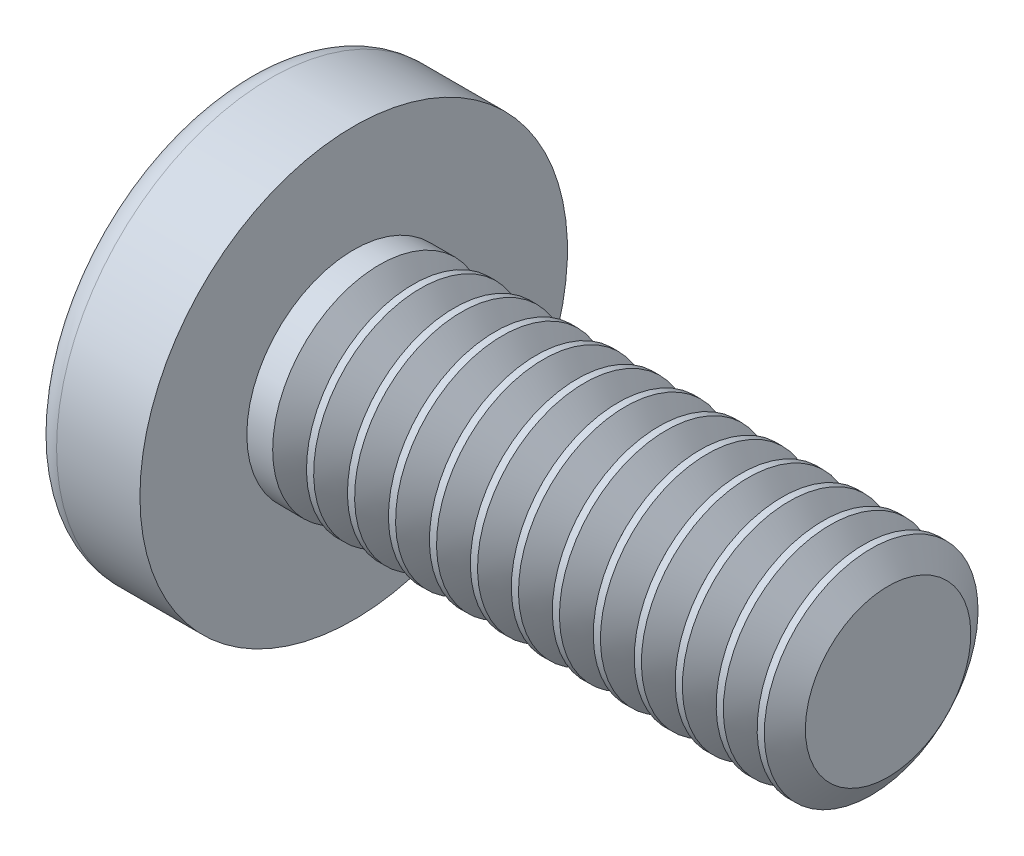
ISO-10303-21;
HEADER;
FILE_DESCRIPTION(('STEP AP214'),'2;1');
FILE_NAME('part.step','',(''),(''),'','','');
FILE_SCHEMA(('AUTOMOTIVE_DESIGN { 1 0 10303 214 1 1 1 1 }'));
ENDSEC;
DATA;
#1=APPLICATION_CONTEXT('core data for automotive mechanical design processes');
#2=APPLICATION_PROTOCOL_DEFINITION('international standard','automotive_design',2000,#1);
#3=PRODUCT_CONTEXT('',#1,'mechanical');
#4=PRODUCT('Part','Part','',(#3));
#5=PRODUCT_RELATED_PRODUCT_CATEGORY('part','',(#4));
#6=PRODUCT_DEFINITION_FORMATION('','',#4);
#7=PRODUCT_DEFINITION_CONTEXT('part definition',#1,'design');
#8=PRODUCT_DEFINITION('design','',#6,#7);
#9=PRODUCT_DEFINITION_SHAPE('','',#8);
#10=(LENGTH_UNIT() NAMED_UNIT(*) SI_UNIT(.MILLI.,.METRE.));
#11=(NAMED_UNIT(*) PLANE_ANGLE_UNIT() SI_UNIT($,.RADIAN.));
#12=(NAMED_UNIT(*) SI_UNIT($,.STERADIAN.) SOLID_ANGLE_UNIT());
#13=UNCERTAINTY_MEASURE_WITH_UNIT(LENGTH_MEASURE(1.E-05),#10,'distance_accuracy_value','');
#14=(GEOMETRIC_REPRESENTATION_CONTEXT(3) GLOBAL_UNCERTAINTY_ASSIGNED_CONTEXT((#13)) GLOBAL_UNIT_ASSIGNED_CONTEXT((#10,
#11,#12)) REPRESENTATION_CONTEXT('',''));
#15=CARTESIAN_POINT('',(0.,0.,0.));
#16=DIRECTION('',(0.,0.,1.));
#17=DIRECTION('',(1.,0.,0.));
#18=AXIS2_PLACEMENT_3D('',#15,#16,#17);
#19=CARTESIAN_POINT('',(3.2,0.,0.));
#20=DIRECTION('',(-1.,0.,0.));
#21=DIRECTION('',(0.,1.,0.));
#22=AXIS2_PLACEMENT_3D('',#19,#20,#21);
#23=SPHERICAL_SURFACE('',#22,3.2);
#24=CARTESIAN_POINT('',(0.627117875780583,0.,0.));
#25=DIRECTION('',(-1.,0.,0.));
#26=DIRECTION('',(0.,0.,1.));
#27=AXIS2_PLACEMENT_3D('',#24,#25,#26);
#28=CIRCLE('',#27,1.9027027027027);
#29=CARTESIAN_POINT('',(0.627117875780583,0.,1.9027027027027));
#30=VERTEX_POINT('',#29);
#31=EDGE_CURVE('E150',#30,#30,#28,.T.);
#32=ORIENTED_EDGE('',*,*,#31,.T.);
#33=EDGE_LOOP('',(#32));
#34=FACE_BOUND('',#33,.T.);
#35=CARTESIAN_POINT('',(3.19174554351625,-0.0818566934638238,0.));
#36=DIRECTION('',(-0.100331502261418,-0.994954064092392,0.));
#37=DIRECTION('',(0.994954064092392,-0.100331502261418,0.));
#38=AXIS2_PLACEMENT_3D('',#35,#36,#37);
#39=CIRCLE('',#38,3.1989422229361);
#40=CARTESIAN_POINT('',(0.118330716626357,0.228067490760364,0.831444314172419));
#41=VERTEX_POINT('',#40);
#42=CARTESIAN_POINT('',(0.0177814447975956,0.238206913129653,0.238206913129654));
#43=VERTEX_POINT('',#42);
#44=EDGE_CURVE('E181',#41,#43,#39,.T.);
#45=ORIENTED_EDGE('',*,*,#44,.F.);
#46=CARTESIAN_POINT('',(2.64043280070581,0.,-0.842892363493775));
#47=DIRECTION('',(0.553083521918191,0.,0.833125811497021));
#48=DIRECTION('',(0.833125811497021,0.,-0.553083521918191));
#49=AXIS2_PLACEMENT_3D('',#46,#47,#48);
#50=CIRCLE('',#49,3.03585523585001);
#51=CARTESIAN_POINT('',(0.118330716626356,-0.22806749076037,0.831444314172419));
#52=VERTEX_POINT('',#51);
#53=EDGE_CURVE('E149',#41,#52,#50,.T.);
#54=ORIENTED_EDGE('',*,*,#53,.T.);
#55=CARTESIAN_POINT('',(3.19174554351625,0.081856693463823,0.));
#56=DIRECTION('',(-0.100331502261417,0.994954064092392,0.));
#57=DIRECTION('',(-0.994954064092392,-0.100331502261417,0.));
#58=AXIS2_PLACEMENT_3D('',#55,#56,#57);
#59=CIRCLE('',#58,3.1989422229361);
#60=CARTESIAN_POINT('',(0.0177814447975943,-0.238206913129655,0.238206913129654));
#61=VERTEX_POINT('',#60);
#62=EDGE_CURVE('E105',#61,#52,#59,.T.);
#63=ORIENTED_EDGE('',*,*,#62,.F.);
#64=CARTESIAN_POINT('',(3.19174554351625,0.,-0.081856693463823));
#65=DIRECTION('',(-0.100331502261417,0.,-0.994954064092392));
#66=DIRECTION('',(-0.994954064092392,0.,0.100331502261417));
#67=AXIS2_PLACEMENT_3D('',#64,#65,#66);
#68=CIRCLE('',#67,3.1989422229361);
#69=CARTESIAN_POINT('',(0.118330716626355,-0.831444314172419,0.228067490760367));
#70=VERTEX_POINT('',#69);
#71=EDGE_CURVE('E130',#70,#61,#68,.T.);
#72=ORIENTED_EDGE('',*,*,#71,.F.);
#73=CARTESIAN_POINT('',(2.64043280070581,0.842892363493772,0.));
#74=DIRECTION('',(0.55308352191819,-0.833125811497022,0.));
#75=DIRECTION('',(0.833125811497022,0.55308352191819,0.));
#76=AXIS2_PLACEMENT_3D('',#73,#74,#75);
#77=CIRCLE('',#76,3.03585523585001);
#78=CARTESIAN_POINT('',(0.118330716626355,-0.831444314172419,-0.228067490760368));
#79=VERTEX_POINT('',#78);
#80=EDGE_CURVE('E138',#70,#79,#77,.T.);
#81=ORIENTED_EDGE('',*,*,#80,.T.);
#82=CARTESIAN_POINT('',(3.19174554351625,0.,0.0818566934638238));
#83=DIRECTION('',(-0.100331502261418,0.,0.994954064092392));
#84=DIRECTION('',(0.994954064092392,0.,0.100331502261418));
#85=AXIS2_PLACEMENT_3D('',#82,#83,#84);
#86=CIRCLE('',#85,3.1989422229361);
#87=CARTESIAN_POINT('',(0.0177814447975947,-0.238206913129653,-0.238206913129654));
#88=VERTEX_POINT('',#87);
#89=EDGE_CURVE('E48',#88,#79,#86,.T.);
#90=ORIENTED_EDGE('',*,*,#89,.F.);
#91=CARTESIAN_POINT('',(0.118330716626356,-0.228067490760364,-0.831444314172419));
#92=VERTEX_POINT('',#91);
#93=EDGE_CURVE('E188',#92,#88,#59,.T.);
#94=ORIENTED_EDGE('',*,*,#93,.F.);
#95=CARTESIAN_POINT('',(2.64043280070581,0.,0.842892363493774));
#96=DIRECTION('',(0.55308352191819,0.,-0.833125811497022));
#97=DIRECTION('',(-0.833125811497022,0.,-0.55308352191819));
#98=AXIS2_PLACEMENT_3D('',#95,#96,#97);
#99=CIRCLE('',#98,3.03585523585001);
#100=CARTESIAN_POINT('',(0.118330716626357,0.22806749076037,-0.831444314172417));
#101=VERTEX_POINT('',#100);
#102=EDGE_CURVE('E131',#92,#101,#99,.T.);
#103=ORIENTED_EDGE('',*,*,#102,.T.);
#104=CARTESIAN_POINT('',(0.0177814447975956,0.238206913129655,-0.238206913129654));
#105=VERTEX_POINT('',#104);
#106=EDGE_CURVE('E176',#105,#101,#39,.T.);
#107=ORIENTED_EDGE('',*,*,#106,.F.);
#108=CARTESIAN_POINT('',(0.118330716626357,0.831444314172418,-0.228067490760367));
#109=VERTEX_POINT('',#108);
#110=EDGE_CURVE('E41',#109,#105,#86,.T.);
#111=ORIENTED_EDGE('',*,*,#110,.F.);
#112=CARTESIAN_POINT('',(2.64043280070582,-0.842892363493777,0.));
#113=DIRECTION('',(0.553083521918191,0.833125811497021,0.));
#114=DIRECTION('',(-0.833125811497021,0.553083521918191,0.));
#115=AXIS2_PLACEMENT_3D('',#112,#113,#114);
#116=CIRCLE('',#115,3.03585523585001);
#117=CARTESIAN_POINT('',(0.118330716626358,0.831444314172418,0.228067490760367));
#118=VERTEX_POINT('',#117);
#119=EDGE_CURVE('E11',#109,#118,#116,.T.);
#120=ORIENTED_EDGE('',*,*,#119,.T.);
#121=EDGE_CURVE('E164',#43,#118,#68,.T.);
#122=ORIENTED_EDGE('',*,*,#121,.F.);
#123=EDGE_LOOP('',(#45,#54,#63,#72,#81,#90,#94,#103,#107,#111,#120,#122));
#124=FACE_BOUND('',#123,.T.);
#125=ADVANCED_FACE('F33',(#34,#124),#23,.T.);
#126=CARTESIAN_POINT('',(1.37075949367089,0.,-0.101772151898734));
#127=DIRECTION('',(-0.100331502261418,0.,0.994954064092392));
#128=DIRECTION('',(0.994954064092392,0.,0.100331502261418));
#129=AXIS2_PLACEMENT_3D('',#126,#127,#128);
#130=PLANE('',#129);
#131=ORIENTED_EDGE('',*,*,#110,.T.);
#132=DIRECTION('',(0.989983749746913,-0.099830294092126,0.0998302940921257));
#133=VECTOR('',#132,1.);
#134=CARTESIAN_POINT('',(1.38081767298512,0.100757881715786,-0.100757881715786));
#135=LINE('',#134,#133);
#136=CARTESIAN_POINT('',(1.19,0.12,-0.12));
#137=VERTEX_POINT('',#136);
#138=EDGE_CURVE('E170',#105,#137,#135,.T.);
#139=ORIENTED_EDGE('',*,*,#138,.T.);
#140=DIRECTION('',(0.830201128729582,-0.551141925795269,0.083717760880294));
#141=VECTOR('',#140,1.);
#142=CARTESIAN_POINT('',(0.,0.91,-0.24));
#143=LINE('',#142,#141);
#144=EDGE_CURVE('E154',#109,#137,#143,.T.);
#145=ORIENTED_EDGE('',*,*,#144,.F.);
#146=EDGE_LOOP('',(#131,#139,#145));
#147=FACE_BOUND('',#146,.T.);
#148=ADVANCED_FACE('F169',(#147),#130,.T.);
#149=DIRECTION('',(0.830201128729583,0.551141925795268,0.083717760880294));
#150=VECTOR('',#149,1.);
#151=CARTESIAN_POINT('',(0.,-0.909999999999998,-0.24));
#152=LINE('',#151,#150);
#153=CARTESIAN_POINT('',(1.19,-0.12,-0.12));
#154=VERTEX_POINT('',#153);
#155=EDGE_CURVE('E139',#79,#154,#152,.T.);
#156=ORIENTED_EDGE('',*,*,#155,.T.);
#157=DIRECTION('',(-0.989983749746913,-0.0998302940921249,-0.0998302940921257));
#158=VECTOR('',#157,1.);
#159=CARTESIAN_POINT('',(1.38081767298512,-0.100757881715786,-0.100757881715786));
#160=LINE('',#159,#158);
#161=EDGE_CURVE('E191',#154,#88,#160,.T.);
#162=ORIENTED_EDGE('',*,*,#161,.T.);
#163=ORIENTED_EDGE('',*,*,#89,.T.);
#164=EDGE_LOOP('',(#156,#162,#163));
#165=FACE_BOUND('',#164,.T.);
#166=ADVANCED_FACE('F333',(#165),#130,.T.);
#167=CARTESIAN_POINT('',(1.37075949367089,0.,0.101772151898734));
#168=DIRECTION('',(-0.100331502261417,0.,-0.994954064092392));
#169=DIRECTION('',(-0.994954064092392,0.,0.100331502261417));
#170=AXIS2_PLACEMENT_3D('',#167,#168,#169);
#171=PLANE('',#170);
#172=DIRECTION('',(0.830201128729582,-0.551141925795269,-0.0837177608802936));
#173=VECTOR('',#172,1.);
#174=CARTESIAN_POINT('',(0.,0.91,0.239999999999999));
#175=LINE('',#174,#173);
#176=CARTESIAN_POINT('',(1.19,0.12,0.12));
#177=VERTEX_POINT('',#176);
#178=EDGE_CURVE('E864',#118,#177,#175,.T.);
#179=ORIENTED_EDGE('',*,*,#178,.T.);
#180=DIRECTION('',(-0.989983749746913,0.0998302940921253,0.0998302940921253));
#181=VECTOR('',#180,1.);
#182=CARTESIAN_POINT('',(1.38081767298512,0.100757881715786,0.100757881715786));
#183=LINE('',#182,#181);
#184=EDGE_CURVE('E185',#177,#43,#183,.T.);
#185=ORIENTED_EDGE('',*,*,#184,.T.);
#186=ORIENTED_EDGE('',*,*,#121,.T.);
#187=EDGE_LOOP('',(#179,#185,#186));
#188=FACE_BOUND('',#187,.T.);
#189=ADVANCED_FACE('F363',(#188),#171,.T.);
#190=ORIENTED_EDGE('',*,*,#71,.T.);
#191=DIRECTION('',(0.989983749746913,0.0998302940921256,-0.0998302940921253));
#192=VECTOR('',#191,1.);
#193=CARTESIAN_POINT('',(1.38081767298512,-0.100757881715786,0.100757881715786));
#194=LINE('',#193,#192);
#195=CARTESIAN_POINT('',(1.19,-0.12,0.119999999999999));
#196=VERTEX_POINT('',#195);
#197=EDGE_CURVE('E103',#61,#196,#194,.T.);
#198=ORIENTED_EDGE('',*,*,#197,.T.);
#199=DIRECTION('',(0.830201128729583,0.551141925795268,-0.0837177608802937));
#200=VECTOR('',#199,1.);
#201=CARTESIAN_POINT('',(0.,-0.909999999999998,0.239999999999999));
#202=LINE('',#201,#200);
#203=EDGE_CURVE('E128',#70,#196,#202,.T.);
#204=ORIENTED_EDGE('',*,*,#203,.F.);
#205=EDGE_LOOP('',(#190,#198,#204));
#206=FACE_BOUND('',#205,.T.);
#207=ADVANCED_FACE('F127',(#206),#171,.T.);
#208=CARTESIAN_POINT('',(-25.4,0.,0.));
#209=DIRECTION('',(-1.,0.,0.));
#210=DIRECTION('',(0.,0.,1.));
#211=AXIS2_PLACEMENT_3D('',#208,#209,#210);
#212=CYLINDRICAL_SURFACE('',#211,1.);
#213=CARTESIAN_POINT('',(1.84175309636461,0.,0.));
#214=DIRECTION('',(-1.,0.,0.));
#215=DIRECTION('',(0.,-1.,0.));
#216=AXIS2_PLACEMENT_3D('',#213,#214,#215);
#217=CIRCLE('',#216,1.);
#218=CARTESIAN_POINT('',(1.84175309636461,-0.999999999999999,0.));
#219=VERTEX_POINT('',#218);
#220=EDGE_CURVE('E203',#219,#219,#217,.T.);
#221=ORIENTED_EDGE('',*,*,#220,.T.);
#222=EDGE_LOOP('',(#221));
#223=FACE_BOUND('',#222,.T.);
#224=CARTESIAN_POINT('',(1.6,0.,0.));
#225=DIRECTION('',(-1.,0.,0.));
#226=DIRECTION('',(0.,0.,1.));
#227=AXIS2_PLACEMENT_3D('',#224,#225,#226);
#228=CIRCLE('',#227,1.);
#229=CARTESIAN_POINT('',(1.6,0.,1.));
#230=VERTEX_POINT('',#229);
#231=EDGE_CURVE('E160',#230,#230,#228,.T.);
#232=ORIENTED_EDGE('',*,*,#231,.F.);
#233=EDGE_LOOP('',(#232));
#234=FACE_BOUND('',#233,.T.);
#235=ADVANCED_FACE('F35',(#223,#234),#212,.T.);
#236=CARTESIAN_POINT('',(1.6,1.,0.));
#237=DIRECTION('',(-1.,0.,0.));
#238=DIRECTION('',(0.,0.,1.));
#239=AXIS2_PLACEMENT_3D('',#236,#237,#238);
#240=PLANE('',#239);
#241=CARTESIAN_POINT('',(1.6,0.,0.));
#242=DIRECTION('',(-1.,0.,0.));
#243=DIRECTION('',(0.,0.,1.));
#244=AXIS2_PLACEMENT_3D('',#241,#242,#243);
#245=CIRCLE('',#244,2.);
#246=CARTESIAN_POINT('',(1.6,0.,2.));
#247=VERTEX_POINT('',#246);
#248=EDGE_CURVE('E157',#247,#247,#245,.T.);
#249=ORIENTED_EDGE('',*,*,#248,.F.);
#250=EDGE_LOOP('',(#249));
#251=FACE_BOUND('',#250,.T.);
#252=ORIENTED_EDGE('',*,*,#231,.T.);
#253=EDGE_LOOP('',(#252));
#254=FACE_BOUND('',#253,.T.);
#255=ADVANCED_FACE('F343',(#251,#254),#240,.F.);
#256=CARTESIAN_POINT('',(-25.4,0.,0.));
#257=DIRECTION('',(-1.,0.,0.));
#258=DIRECTION('',(0.,0.,1.));
#259=AXIS2_PLACEMENT_3D('',#256,#257,#258);
#260=CYLINDRICAL_SURFACE('',#259,2.);
#261=ORIENTED_EDGE('',*,*,#248,.T.);
#262=EDGE_LOOP('',(#261));
#263=FACE_BOUND('',#262,.T.);
#264=CARTESIAN_POINT('',(0.820084035097042,0.,0.));
#265=DIRECTION('',(-1.,0.,0.));
#266=DIRECTION('',(0.,0.,1.));
#267=AXIS2_PLACEMENT_3D('',#264,#265,#266);
#268=CIRCLE('',#267,2.);
#269=CARTESIAN_POINT('',(0.820084035097042,0.,2.));
#270=VERTEX_POINT('',#269);
#271=EDGE_CURVE('E153',#270,#270,#268,.T.);
#272=ORIENTED_EDGE('',*,*,#271,.F.);
#273=EDGE_LOOP('',(#272));
#274=FACE_BOUND('',#273,.T.);
#275=ADVANCED_FACE('F340',(#263,#274),#260,.T.);
#276=CARTESIAN_POINT('',(0.820084035097042,0.,0.));
#277=DIRECTION('',(-1.,0.,0.));
#278=DIRECTION('',(0.,0.,1.));
#279=AXIS2_PLACEMENT_3D('',#276,#277,#278);
#280=TOROIDAL_SURFACE('',#279,1.76,0.24);
#281=ORIENTED_EDGE('',*,*,#271,.T.);
#282=EDGE_LOOP('',(#281));
#283=FACE_BOUND('',#282,.T.);
#284=ORIENTED_EDGE('',*,*,#31,.F.);
#285=EDGE_LOOP('',(#284));
#286=FACE_BOUND('',#285,.T.);
#287=ADVANCED_FACE('F336',(#283,#286),#280,.T.);
#288=CARTESIAN_POINT('',(1.19,0.12,0.12));
#289=DIRECTION('',(0.553083521918191,0.833125811497021,0.));
#290=DIRECTION('',(-0.833125811497021,0.553083521918191,0.));
#291=AXIS2_PLACEMENT_3D('',#288,#289,#290);
#292=PLANE('',#291);
#293=ORIENTED_EDGE('',*,*,#144,.T.);
#294=DIRECTION('',(0.,0.,-1.));
#295=VECTOR('',#294,1.);
#296=CARTESIAN_POINT('',(1.19,0.12,0.12));
#297=LINE('',#296,#295);
#298=EDGE_CURVE('E121',#177,#137,#297,.T.);
#299=ORIENTED_EDGE('',*,*,#298,.F.);
#300=ORIENTED_EDGE('',*,*,#178,.F.);
#301=ORIENTED_EDGE('',*,*,#119,.F.);
#302=EDGE_LOOP('',(#293,#299,#300,#301));
#303=FACE_BOUND('',#302,.T.);
#304=ADVANCED_FACE('F339',(#303),#292,.F.);
#305=CARTESIAN_POINT('',(0.,-0.909999999999998,-0.24));
#306=DIRECTION('',(0.55308352191819,-0.833125811497022,0.));
#307=DIRECTION('',(0.833125811497022,0.55308352191819,0.));
#308=AXIS2_PLACEMENT_3D('',#305,#306,#307);
#309=PLANE('',#308);
#310=ORIENTED_EDGE('',*,*,#203,.T.);
#311=DIRECTION('',(0.,0.,1.));
#312=VECTOR('',#311,1.);
#313=CARTESIAN_POINT('',(1.19,-0.12,-0.12));
#314=LINE('',#313,#312);
#315=EDGE_CURVE('E120',#154,#196,#314,.T.);
#316=ORIENTED_EDGE('',*,*,#315,.F.);
#317=ORIENTED_EDGE('',*,*,#155,.F.);
#318=ORIENTED_EDGE('',*,*,#80,.F.);
#319=EDGE_LOOP('',(#310,#316,#317,#318));
#320=FACE_BOUND('',#319,.T.);
#321=ADVANCED_FACE('F135',(#320),#309,.F.);
#322=CARTESIAN_POINT('',(1.19,0.12,-0.12));
#323=DIRECTION('',(-1.,0.,0.));
#324=DIRECTION('',(0.,0.,1.));
#325=AXIS2_PLACEMENT_3D('',#322,#323,#324);
#326=PLANE('',#325);
#327=DIRECTION('',(0.,1.,0.));
#328=VECTOR('',#327,1.);
#329=CARTESIAN_POINT('',(1.19,-0.12,-0.12));
#330=LINE('',#329,#328);
#331=EDGE_CURVE('E143',#154,#137,#330,.T.);
#332=ORIENTED_EDGE('',*,*,#331,.F.);
#333=ORIENTED_EDGE('',*,*,#315,.T.);
#334=DIRECTION('',(0.,-1.,0.));
#335=VECTOR('',#334,1.);
#336=CARTESIAN_POINT('',(1.19,0.12,0.12));
#337=LINE('',#336,#335);
#338=EDGE_CURVE('E112',#177,#196,#337,.T.);
#339=ORIENTED_EDGE('',*,*,#338,.F.);
#340=ORIENTED_EDGE('',*,*,#298,.T.);
#341=EDGE_LOOP('',(#332,#333,#339,#340));
#342=FACE_BOUND('',#341,.T.);
#343=ADVANCED_FACE('F141',(#342),#326,.T.);
#344=CARTESIAN_POINT('',(0.,0.240000000000003,-0.909999999999998));
#345=DIRECTION('',(0.55308352191819,0.,-0.833125811497022));
#346=DIRECTION('',(0.833125811497022,0.,0.55308352191819));
#347=AXIS2_PLACEMENT_3D('',#344,#345,#346);
#348=PLANE('',#347);
#349=DIRECTION('',(0.830201128729583,0.0837177608802917,0.551141925795268));
#350=VECTOR('',#349,1.);
#351=CARTESIAN_POINT('',(0.,-0.239999999999996,-0.909999999999999));
#352=LINE('',#351,#350);
#353=EDGE_CURVE('E196',#92,#154,#352,.T.);
#354=ORIENTED_EDGE('',*,*,#353,.T.);
#355=ORIENTED_EDGE('',*,*,#331,.T.);
#356=DIRECTION('',(0.830201128729583,-0.0837177608802959,0.551141925795268));
#357=VECTOR('',#356,1.);
#358=CARTESIAN_POINT('',(0.,0.240000000000003,-0.909999999999998));
#359=LINE('',#358,#357);
#360=EDGE_CURVE('E109',#101,#137,#359,.T.);
#361=ORIENTED_EDGE('',*,*,#360,.F.);
#362=ORIENTED_EDGE('',*,*,#102,.F.);
#363=EDGE_LOOP('',(#354,#355,#361,#362));
#364=FACE_BOUND('',#363,.T.);
#365=ADVANCED_FACE('F548',(#364),#348,.F.);
#366=CARTESIAN_POINT('',(1.37075949367089,-0.101772151898734,0.));
#367=DIRECTION('',(-0.100331502261417,0.994954064092392,0.));
#368=DIRECTION('',(-0.994954064092392,-0.100331502261417,0.));
#369=AXIS2_PLACEMENT_3D('',#366,#367,#368);
#370=PLANE('',#369);
#371=ORIENTED_EDGE('',*,*,#93,.T.);
#372=ORIENTED_EDGE('',*,*,#161,.F.);
#373=ORIENTED_EDGE('',*,*,#353,.F.);
#374=EDGE_LOOP('',(#371,#372,#373));
#375=FACE_BOUND('',#374,.T.);
#376=ADVANCED_FACE('F545',(#375),#370,.T.);
#377=CARTESIAN_POINT('',(1.37075949367089,0.101772151898734,0.));
#378=DIRECTION('',(-0.100331502261418,-0.994954064092392,0.));
#379=DIRECTION('',(0.994954064092392,-0.100331502261418,0.));
#380=AXIS2_PLACEMENT_3D('',#377,#378,#379);
#381=PLANE('',#380);
#382=ORIENTED_EDGE('',*,*,#106,.T.);
#383=ORIENTED_EDGE('',*,*,#360,.T.);
#384=ORIENTED_EDGE('',*,*,#138,.F.);
#385=EDGE_LOOP('',(#382,#383,#384));
#386=FACE_BOUND('',#385,.T.);
#387=ADVANCED_FACE('F542',(#386),#381,.T.);
#388=CARTESIAN_POINT('',(1.19,-0.12,0.12));
#389=DIRECTION('',(0.553083521918191,0.,0.833125811497021));
#390=DIRECTION('',(-0.833125811497021,0.,0.553083521918191));
#391=AXIS2_PLACEMENT_3D('',#388,#389,#390);
#392=PLANE('',#391);
#393=DIRECTION('',(0.830201128729582,-0.0837177608802921,-0.551141925795269));
#394=VECTOR('',#393,1.);
#395=CARTESIAN_POINT('',(0.,0.239999999999997,0.910000000000001));
#396=LINE('',#395,#394);
#397=EDGE_CURVE('E108',#41,#177,#396,.T.);
#398=ORIENTED_EDGE('',*,*,#397,.T.);
#399=ORIENTED_EDGE('',*,*,#338,.T.);
#400=DIRECTION('',(0.830201128729582,0.0837177608802956,-0.551141925795269));
#401=VECTOR('',#400,1.);
#402=CARTESIAN_POINT('',(0.,-0.240000000000003,0.909999999999999));
#403=LINE('',#402,#401);
#404=EDGE_CURVE('E99',#52,#196,#403,.T.);
#405=ORIENTED_EDGE('',*,*,#404,.F.);
#406=ORIENTED_EDGE('',*,*,#53,.F.);
#407=EDGE_LOOP('',(#398,#399,#405,#406));
#408=FACE_BOUND('',#407,.T.);
#409=ADVANCED_FACE('F113',(#408),#392,.F.);
#410=ORIENTED_EDGE('',*,*,#44,.T.);
#411=ORIENTED_EDGE('',*,*,#184,.F.);
#412=ORIENTED_EDGE('',*,*,#397,.F.);
#413=EDGE_LOOP('',(#410,#411,#412));
#414=FACE_BOUND('',#413,.T.);
#415=ADVANCED_FACE('F541',(#414),#381,.T.);
#416=ORIENTED_EDGE('',*,*,#62,.T.);
#417=ORIENTED_EDGE('',*,*,#404,.T.);
#418=ORIENTED_EDGE('',*,*,#197,.F.);
#419=EDGE_LOOP('',(#416,#417,#418));
#420=FACE_BOUND('',#419,.T.);
#421=ADVANCED_FACE('F101',(#420),#370,.T.);
#422=CARTESIAN_POINT('',(2.15824690363539,0.,0.));
#423=DIRECTION('',(1.,0.,0.));
#424=DIRECTION('',(0.,1.,0.));
#425=AXIS2_PLACEMENT_3D('',#422,#423,#424);
#426=CONICAL_SURFACE('',#425,1.,0.959931088596885);
#427=CARTESIAN_POINT('',(2.,0.,0.));
#428=DIRECTION('',(-1.,0.,0.));
#429=DIRECTION('',(0.,-1.,0.));
#430=AXIS2_PLACEMENT_3D('',#427,#428,#429);
#431=CIRCLE('',#430,0.774000000000001);
#432=CARTESIAN_POINT('',(2.,-0.774,0.));
#433=VERTEX_POINT('',#432);
#434=EDGE_CURVE('E206',#433,#433,#431,.T.);
#435=ORIENTED_EDGE('',*,*,#434,.F.);
#436=EDGE_LOOP('',(#435));
#437=FACE_BOUND('',#436,.T.);
#438=CARTESIAN_POINT('',(2.15824690363539,0.,0.));
#439=DIRECTION('',(-1.,0.,0.));
#440=DIRECTION('',(0.,-1.,0.));
#441=AXIS2_PLACEMENT_3D('',#438,#439,#440);
#442=CIRCLE('',#441,1.);
#443=CARTESIAN_POINT('',(2.15824690363539,-1.,0.));
#444=VERTEX_POINT('',#443);
#445=EDGE_CURVE('E198',#444,#444,#442,.T.);
#446=ORIENTED_EDGE('',*,*,#445,.T.);
#447=EDGE_LOOP('',(#446));
#448=FACE_BOUND('',#447,.T.);
#449=ADVANCED_FACE('F381',(#437,#448),#426,.T.);
#450=CARTESIAN_POINT('',(2.,0.,0.));
#451=DIRECTION('',(-1.,0.,0.));
#452=DIRECTION('',(0.,-1.,0.));
#453=AXIS2_PLACEMENT_3D('',#450,#451,#452);
#454=CONICAL_SURFACE('',#453,0.774000000000001,0.959931088596878);
#455=ORIENTED_EDGE('',*,*,#220,.F.);
#456=EDGE_LOOP('',(#455));
#457=FACE_BOUND('',#456,.T.);
#458=ORIENTED_EDGE('',*,*,#434,.T.);
#459=EDGE_LOOP('',(#458));
#460=FACE_BOUND('',#459,.T.);
#461=ADVANCED_FACE('F371',(#457,#460),#454,.T.);
#462=CARTESIAN_POINT('',(2.22508642969794,0.,0.));
#463=DIRECTION('',(-1.,0.,0.));
#464=DIRECTION('',(0.,-1.,0.));
#465=AXIS2_PLACEMENT_3D('',#462,#463,#464);
#466=CIRCLE('',#465,1.);
#467=CARTESIAN_POINT('',(2.22508642969794,-0.999999999999999,0.));
#468=VERTEX_POINT('',#467);
#469=EDGE_CURVE('E212',#468,#468,#466,.T.);
#470=ORIENTED_EDGE('',*,*,#469,.T.);
#471=EDGE_LOOP('',(#470));
#472=FACE_BOUND('',#471,.T.);
#473=ORIENTED_EDGE('',*,*,#445,.F.);
#474=EDGE_LOOP('',(#473));
#475=FACE_BOUND('',#474,.T.);
#476=ADVANCED_FACE('F351',(#472,#475),#212,.T.);
#477=CARTESIAN_POINT('',(2.54158023696873,0.,0.));
#478=DIRECTION('',(1.,0.,0.));
#479=DIRECTION('',(0.,1.,0.));
#480=AXIS2_PLACEMENT_3D('',#477,#478,#479);
#481=CONICAL_SURFACE('',#480,1.,0.959931088596885);
#482=CARTESIAN_POINT('',(2.38333333333333,0.,0.));
#483=DIRECTION('',(-1.,0.,0.));
#484=DIRECTION('',(0.,-1.,0.));
#485=AXIS2_PLACEMENT_3D('',#482,#483,#484);
#486=CIRCLE('',#485,0.774000000000001);
#487=CARTESIAN_POINT('',(2.38333333333333,-0.774,0.));
#488=VERTEX_POINT('',#487);
#489=EDGE_CURVE('E215',#488,#488,#486,.T.);
#490=ORIENTED_EDGE('',*,*,#489,.F.);
#491=EDGE_LOOP('',(#490));
#492=FACE_BOUND('',#491,.T.);
#493=CARTESIAN_POINT('',(2.54158023696873,0.,0.));
#494=DIRECTION('',(-1.,0.,0.));
#495=DIRECTION('',(0.,-1.,0.));
#496=AXIS2_PLACEMENT_3D('',#493,#494,#495);
#497=CIRCLE('',#496,1.);
#498=CARTESIAN_POINT('',(2.54158023696873,-1.,0.));
#499=VERTEX_POINT('',#498);
#500=EDGE_CURVE('E209',#499,#499,#497,.T.);
#501=ORIENTED_EDGE('',*,*,#500,.T.);
#502=EDGE_LOOP('',(#501));
#503=FACE_BOUND('',#502,.T.);
#504=ADVANCED_FACE('F370',(#492,#503),#481,.T.);
#505=CARTESIAN_POINT('',(2.38333333333333,0.,0.));
#506=DIRECTION('',(-1.,0.,0.));
#507=DIRECTION('',(0.,-1.,0.));
#508=AXIS2_PLACEMENT_3D('',#505,#506,#507);
#509=CONICAL_SURFACE('',#508,0.774000000000001,0.959931088596878);
#510=ORIENTED_EDGE('',*,*,#469,.F.);
#511=EDGE_LOOP('',(#510));
#512=FACE_BOUND('',#511,.T.);
#513=ORIENTED_EDGE('',*,*,#489,.T.);
#514=EDGE_LOOP('',(#513));
#515=FACE_BOUND('',#514,.T.);
#516=ADVANCED_FACE('F378',(#512,#515),#509,.T.);
#517=CARTESIAN_POINT('',(2.60841976303127,0.,0.));
#518=DIRECTION('',(-1.,0.,0.));
#519=DIRECTION('',(0.,-1.,0.));
#520=AXIS2_PLACEMENT_3D('',#517,#518,#519);
#521=CIRCLE('',#520,1.);
#522=CARTESIAN_POINT('',(2.60841976303127,-0.999999999999999,0.));
#523=VERTEX_POINT('',#522);
#524=EDGE_CURVE('E221',#523,#523,#521,.T.);
#525=ORIENTED_EDGE('',*,*,#524,.T.);
#526=EDGE_LOOP('',(#525));
#527=FACE_BOUND('',#526,.T.);
#528=ORIENTED_EDGE('',*,*,#500,.F.);
#529=EDGE_LOOP('',(#528));
#530=FACE_BOUND('',#529,.T.);
#531=ADVANCED_FACE('F373',(#527,#530),#212,.T.);
#532=CARTESIAN_POINT('',(2.92491357030206,0.,0.));
#533=DIRECTION('',(1.,0.,0.));
#534=DIRECTION('',(0.,1.,0.));
#535=AXIS2_PLACEMENT_3D('',#532,#533,#534);
#536=CONICAL_SURFACE('',#535,1.,0.959931088596885);
#537=CARTESIAN_POINT('',(2.76666666666667,0.,0.));
#538=DIRECTION('',(-1.,0.,0.));
#539=DIRECTION('',(0.,-1.,0.));
#540=AXIS2_PLACEMENT_3D('',#537,#538,#539);
#541=CIRCLE('',#540,0.774000000000001);
#542=CARTESIAN_POINT('',(2.76666666666667,-0.774,0.));
#543=VERTEX_POINT('',#542);
#544=EDGE_CURVE('E224',#543,#543,#541,.T.);
#545=ORIENTED_EDGE('',*,*,#544,.F.);
#546=EDGE_LOOP('',(#545));
#547=FACE_BOUND('',#546,.T.);
#548=CARTESIAN_POINT('',(2.92491357030206,0.,0.));
#549=DIRECTION('',(-1.,0.,0.));
#550=DIRECTION('',(0.,-1.,0.));
#551=AXIS2_PLACEMENT_3D('',#548,#549,#550);
#552=CIRCLE('',#551,1.);
#553=CARTESIAN_POINT('',(2.92491357030206,-1.,0.));
#554=VERTEX_POINT('',#553);
#555=EDGE_CURVE('E218',#554,#554,#552,.T.);
#556=ORIENTED_EDGE('',*,*,#555,.T.);
#557=EDGE_LOOP('',(#556));
#558=FACE_BOUND('',#557,.T.);
#559=ADVANCED_FACE('F386',(#547,#558),#536,.T.);
#560=CARTESIAN_POINT('',(2.76666666666667,0.,0.));
#561=DIRECTION('',(-1.,0.,0.));
#562=DIRECTION('',(0.,-1.,0.));
#563=AXIS2_PLACEMENT_3D('',#560,#561,#562);
#564=CONICAL_SURFACE('',#563,0.774000000000001,0.959931088596878);
#565=ORIENTED_EDGE('',*,*,#524,.F.);
#566=EDGE_LOOP('',(#565));
#567=FACE_BOUND('',#566,.T.);
#568=ORIENTED_EDGE('',*,*,#544,.T.);
#569=EDGE_LOOP('',(#568));
#570=FACE_BOUND('',#569,.T.);
#571=ADVANCED_FACE('F393',(#567,#570),#564,.T.);
#572=CARTESIAN_POINT('',(2.99175309636461,0.,0.));
#573=DIRECTION('',(-1.,0.,0.));
#574=DIRECTION('',(0.,-1.,0.));
#575=AXIS2_PLACEMENT_3D('',#572,#573,#574);
#576=CIRCLE('',#575,1.);
#577=CARTESIAN_POINT('',(2.99175309636461,-0.999999999999999,0.));
#578=VERTEX_POINT('',#577);
#579=EDGE_CURVE('E230',#578,#578,#576,.T.);
#580=ORIENTED_EDGE('',*,*,#579,.T.);
#581=EDGE_LOOP('',(#580));
#582=FACE_BOUND('',#581,.T.);
#583=ORIENTED_EDGE('',*,*,#555,.F.);
#584=EDGE_LOOP('',(#583));
#585=FACE_BOUND('',#584,.T.);
#586=ADVANCED_FACE('F388',(#582,#585),#212,.T.);
#587=CARTESIAN_POINT('',(3.30824690363539,0.,0.));
#588=DIRECTION('',(1.,0.,0.));
#589=DIRECTION('',(0.,1.,0.));
#590=AXIS2_PLACEMENT_3D('',#587,#588,#589);
#591=CONICAL_SURFACE('',#590,1.,0.959931088596885);
#592=CARTESIAN_POINT('',(3.15,0.,0.));
#593=DIRECTION('',(-1.,0.,0.));
#594=DIRECTION('',(0.,-1.,0.));
#595=AXIS2_PLACEMENT_3D('',#592,#593,#594);
#596=CIRCLE('',#595,0.774000000000001);
#597=CARTESIAN_POINT('',(3.15,-0.774,0.));
#598=VERTEX_POINT('',#597);
#599=EDGE_CURVE('E233',#598,#598,#596,.T.);
#600=ORIENTED_EDGE('',*,*,#599,.F.);
#601=EDGE_LOOP('',(#600));
#602=FACE_BOUND('',#601,.T.);
#603=CARTESIAN_POINT('',(3.30824690363539,0.,0.));
#604=DIRECTION('',(-1.,0.,0.));
#605=DIRECTION('',(0.,-1.,0.));
#606=AXIS2_PLACEMENT_3D('',#603,#604,#605);
#607=CIRCLE('',#606,1.);
#608=CARTESIAN_POINT('',(3.30824690363539,-1.,0.));
#609=VERTEX_POINT('',#608);
#610=EDGE_CURVE('E227',#609,#609,#607,.T.);
#611=ORIENTED_EDGE('',*,*,#610,.T.);
#612=EDGE_LOOP('',(#611));
#613=FACE_BOUND('',#612,.T.);
#614=ADVANCED_FACE('F400',(#602,#613),#591,.T.);
#615=CARTESIAN_POINT('',(3.15,0.,0.));
#616=DIRECTION('',(-1.,0.,0.));
#617=DIRECTION('',(0.,-1.,0.));
#618=AXIS2_PLACEMENT_3D('',#615,#616,#617);
#619=CONICAL_SURFACE('',#618,0.774000000000001,0.959931088596878);
#620=ORIENTED_EDGE('',*,*,#579,.F.);
#621=EDGE_LOOP('',(#620));
#622=FACE_BOUND('',#621,.T.);
#623=ORIENTED_EDGE('',*,*,#599,.T.);
#624=EDGE_LOOP('',(#623));
#625=FACE_BOUND('',#624,.T.);
#626=ADVANCED_FACE('F407',(#622,#625),#619,.T.);
#627=CARTESIAN_POINT('',(3.37508642969794,0.,0.));
#628=DIRECTION('',(-1.,0.,0.));
#629=DIRECTION('',(0.,-1.,0.));
#630=AXIS2_PLACEMENT_3D('',#627,#628,#629);
#631=CIRCLE('',#630,1.);
#632=CARTESIAN_POINT('',(3.37508642969794,-0.999999999999999,0.));
#633=VERTEX_POINT('',#632);
#634=EDGE_CURVE('E239',#633,#633,#631,.T.);
#635=ORIENTED_EDGE('',*,*,#634,.T.);
#636=EDGE_LOOP('',(#635));
#637=FACE_BOUND('',#636,.T.);
#638=ORIENTED_EDGE('',*,*,#610,.F.);
#639=EDGE_LOOP('',(#638));
#640=FACE_BOUND('',#639,.T.);
#641=ADVANCED_FACE('F402',(#637,#640),#212,.T.);
#642=CARTESIAN_POINT('',(3.69158023696873,0.,0.));
#643=DIRECTION('',(1.,0.,0.));
#644=DIRECTION('',(0.,1.,0.));
#645=AXIS2_PLACEMENT_3D('',#642,#643,#644);
#646=CONICAL_SURFACE('',#645,1.,0.959931088596885);
#647=CARTESIAN_POINT('',(3.53333333333333,0.,0.));
#648=DIRECTION('',(-1.,0.,0.));
#649=DIRECTION('',(0.,-1.,0.));
#650=AXIS2_PLACEMENT_3D('',#647,#648,#649);
#651=CIRCLE('',#650,0.774000000000001);
#652=CARTESIAN_POINT('',(3.53333333333333,-0.774,0.));
#653=VERTEX_POINT('',#652);
#654=EDGE_CURVE('E242',#653,#653,#651,.T.);
#655=ORIENTED_EDGE('',*,*,#654,.F.);
#656=EDGE_LOOP('',(#655));
#657=FACE_BOUND('',#656,.T.);
#658=CARTESIAN_POINT('',(3.69158023696873,0.,0.));
#659=DIRECTION('',(-1.,0.,0.));
#660=DIRECTION('',(0.,-1.,0.));
#661=AXIS2_PLACEMENT_3D('',#658,#659,#660);
#662=CIRCLE('',#661,1.);
#663=CARTESIAN_POINT('',(3.69158023696873,-1.,0.));
#664=VERTEX_POINT('',#663);
#665=EDGE_CURVE('E236',#664,#664,#662,.T.);
#666=ORIENTED_EDGE('',*,*,#665,.T.);
#667=EDGE_LOOP('',(#666));
#668=FACE_BOUND('',#667,.T.);
#669=ADVANCED_FACE('F414',(#657,#668),#646,.T.);
#670=CARTESIAN_POINT('',(3.53333333333333,0.,0.));
#671=DIRECTION('',(-1.,0.,0.));
#672=DIRECTION('',(0.,-1.,0.));
#673=AXIS2_PLACEMENT_3D('',#670,#671,#672);
#674=CONICAL_SURFACE('',#673,0.774000000000001,0.959931088596878);
#675=ORIENTED_EDGE('',*,*,#634,.F.);
#676=EDGE_LOOP('',(#675));
#677=FACE_BOUND('',#676,.T.);
#678=ORIENTED_EDGE('',*,*,#654,.T.);
#679=EDGE_LOOP('',(#678));
#680=FACE_BOUND('',#679,.T.);
#681=ADVANCED_FACE('F421',(#677,#680),#674,.T.);
#682=CARTESIAN_POINT('',(3.75841976303127,0.,0.));
#683=DIRECTION('',(-1.,0.,0.));
#684=DIRECTION('',(0.,-1.,0.));
#685=AXIS2_PLACEMENT_3D('',#682,#683,#684);
#686=CIRCLE('',#685,1.);
#687=CARTESIAN_POINT('',(3.75841976303127,-0.999999999999999,0.));
#688=VERTEX_POINT('',#687);
#689=EDGE_CURVE('E248',#688,#688,#686,.T.);
#690=ORIENTED_EDGE('',*,*,#689,.T.);
#691=EDGE_LOOP('',(#690));
#692=FACE_BOUND('',#691,.T.);
#693=ORIENTED_EDGE('',*,*,#665,.F.);
#694=EDGE_LOOP('',(#693));
#695=FACE_BOUND('',#694,.T.);
#696=ADVANCED_FACE('F416',(#692,#695),#212,.T.);
#697=CARTESIAN_POINT('',(4.07491357030206,0.,0.));
#698=DIRECTION('',(1.,0.,0.));
#699=DIRECTION('',(0.,1.,0.));
#700=AXIS2_PLACEMENT_3D('',#697,#698,#699);
#701=CONICAL_SURFACE('',#700,1.,0.959931088596885);
#702=CARTESIAN_POINT('',(3.91666666666667,0.,0.));
#703=DIRECTION('',(-1.,0.,0.));
#704=DIRECTION('',(0.,-1.,0.));
#705=AXIS2_PLACEMENT_3D('',#702,#703,#704);
#706=CIRCLE('',#705,0.774000000000001);
#707=CARTESIAN_POINT('',(3.91666666666667,-0.774,0.));
#708=VERTEX_POINT('',#707);
#709=EDGE_CURVE('E251',#708,#708,#706,.T.);
#710=ORIENTED_EDGE('',*,*,#709,.F.);
#711=EDGE_LOOP('',(#710));
#712=FACE_BOUND('',#711,.T.);
#713=CARTESIAN_POINT('',(4.07491357030206,0.,0.));
#714=DIRECTION('',(-1.,0.,0.));
#715=DIRECTION('',(0.,-1.,0.));
#716=AXIS2_PLACEMENT_3D('',#713,#714,#715);
#717=CIRCLE('',#716,1.);
#718=CARTESIAN_POINT('',(4.07491357030206,-1.,0.));
#719=VERTEX_POINT('',#718);
#720=EDGE_CURVE('E245',#719,#719,#717,.T.);
#721=ORIENTED_EDGE('',*,*,#720,.T.);
#722=EDGE_LOOP('',(#721));
#723=FACE_BOUND('',#722,.T.);
#724=ADVANCED_FACE('F428',(#712,#723),#701,.T.);
#725=CARTESIAN_POINT('',(3.91666666666667,0.,0.));
#726=DIRECTION('',(-1.,0.,0.));
#727=DIRECTION('',(0.,-1.,0.));
#728=AXIS2_PLACEMENT_3D('',#725,#726,#727);
#729=CONICAL_SURFACE('',#728,0.774000000000001,0.959931088596878);
#730=ORIENTED_EDGE('',*,*,#689,.F.);
#731=EDGE_LOOP('',(#730));
#732=FACE_BOUND('',#731,.T.);
#733=ORIENTED_EDGE('',*,*,#709,.T.);
#734=EDGE_LOOP('',(#733));
#735=FACE_BOUND('',#734,.T.);
#736=ADVANCED_FACE('F435',(#732,#735),#729,.T.);
#737=CARTESIAN_POINT('',(4.14175309636461,0.,0.));
#738=DIRECTION('',(-1.,0.,0.));
#739=DIRECTION('',(0.,-1.,0.));
#740=AXIS2_PLACEMENT_3D('',#737,#738,#739);
#741=CIRCLE('',#740,1.);
#742=CARTESIAN_POINT('',(4.14175309636461,-0.999999999999999,0.));
#743=VERTEX_POINT('',#742);
#744=EDGE_CURVE('E257',#743,#743,#741,.T.);
#745=ORIENTED_EDGE('',*,*,#744,.T.);
#746=EDGE_LOOP('',(#745));
#747=FACE_BOUND('',#746,.T.);
#748=ORIENTED_EDGE('',*,*,#720,.F.);
#749=EDGE_LOOP('',(#748));
#750=FACE_BOUND('',#749,.T.);
#751=ADVANCED_FACE('F430',(#747,#750),#212,.T.);
#752=CARTESIAN_POINT('',(4.45824690363539,0.,0.));
#753=DIRECTION('',(1.,0.,0.));
#754=DIRECTION('',(0.,1.,0.));
#755=AXIS2_PLACEMENT_3D('',#752,#753,#754);
#756=CONICAL_SURFACE('',#755,1.,0.959931088596885);
#757=CARTESIAN_POINT('',(4.3,0.,0.));
#758=DIRECTION('',(-1.,0.,0.));
#759=DIRECTION('',(0.,-1.,0.));
#760=AXIS2_PLACEMENT_3D('',#757,#758,#759);
#761=CIRCLE('',#760,0.774000000000001);
#762=CARTESIAN_POINT('',(4.3,-0.774,0.));
#763=VERTEX_POINT('',#762);
#764=EDGE_CURVE('E260',#763,#763,#761,.T.);
#765=ORIENTED_EDGE('',*,*,#764,.F.);
#766=EDGE_LOOP('',(#765));
#767=FACE_BOUND('',#766,.T.);
#768=CARTESIAN_POINT('',(4.45824690363539,0.,0.));
#769=DIRECTION('',(-1.,0.,0.));
#770=DIRECTION('',(0.,-1.,0.));
#771=AXIS2_PLACEMENT_3D('',#768,#769,#770);
#772=CIRCLE('',#771,1.);
#773=CARTESIAN_POINT('',(4.45824690363539,-1.,0.));
#774=VERTEX_POINT('',#773);
#775=EDGE_CURVE('E254',#774,#774,#772,.T.);
#776=ORIENTED_EDGE('',*,*,#775,.T.);
#777=EDGE_LOOP('',(#776));
#778=FACE_BOUND('',#777,.T.);
#779=ADVANCED_FACE('F442',(#767,#778),#756,.T.);
#780=CARTESIAN_POINT('',(4.3,0.,0.));
#781=DIRECTION('',(-1.,0.,0.));
#782=DIRECTION('',(0.,-1.,0.));
#783=AXIS2_PLACEMENT_3D('',#780,#781,#782);
#784=CONICAL_SURFACE('',#783,0.774000000000001,0.959931088596878);
#785=ORIENTED_EDGE('',*,*,#744,.F.);
#786=EDGE_LOOP('',(#785));
#787=FACE_BOUND('',#786,.T.);
#788=ORIENTED_EDGE('',*,*,#764,.T.);
#789=EDGE_LOOP('',(#788));
#790=FACE_BOUND('',#789,.T.);
#791=ADVANCED_FACE('F449',(#787,#790),#784,.T.);
#792=CARTESIAN_POINT('',(4.52508642969794,0.,0.));
#793=DIRECTION('',(-1.,0.,0.));
#794=DIRECTION('',(0.,-1.,0.));
#795=AXIS2_PLACEMENT_3D('',#792,#793,#794);
#796=CIRCLE('',#795,1.);
#797=CARTESIAN_POINT('',(4.52508642969794,-0.999999999999999,0.));
#798=VERTEX_POINT('',#797);
#799=EDGE_CURVE('E266',#798,#798,#796,.T.);
#800=ORIENTED_EDGE('',*,*,#799,.T.);
#801=EDGE_LOOP('',(#800));
#802=FACE_BOUND('',#801,.T.);
#803=ORIENTED_EDGE('',*,*,#775,.F.);
#804=EDGE_LOOP('',(#803));
#805=FACE_BOUND('',#804,.T.);
#806=ADVANCED_FACE('F444',(#802,#805),#212,.T.);
#807=CARTESIAN_POINT('',(4.84158023696873,0.,0.));
#808=DIRECTION('',(1.,0.,0.));
#809=DIRECTION('',(0.,1.,0.));
#810=AXIS2_PLACEMENT_3D('',#807,#808,#809);
#811=CONICAL_SURFACE('',#810,1.,0.959931088596885);
#812=CARTESIAN_POINT('',(4.68333333333333,0.,0.));
#813=DIRECTION('',(-1.,0.,0.));
#814=DIRECTION('',(0.,-1.,0.));
#815=AXIS2_PLACEMENT_3D('',#812,#813,#814);
#816=CIRCLE('',#815,0.774000000000001);
#817=CARTESIAN_POINT('',(4.68333333333333,-0.774,0.));
#818=VERTEX_POINT('',#817);
#819=EDGE_CURVE('E269',#818,#818,#816,.T.);
#820=ORIENTED_EDGE('',*,*,#819,.F.);
#821=EDGE_LOOP('',(#820));
#822=FACE_BOUND('',#821,.T.);
#823=CARTESIAN_POINT('',(4.84158023696873,0.,0.));
#824=DIRECTION('',(-1.,0.,0.));
#825=DIRECTION('',(0.,-1.,0.));
#826=AXIS2_PLACEMENT_3D('',#823,#824,#825);
#827=CIRCLE('',#826,1.);
#828=CARTESIAN_POINT('',(4.84158023696873,-1.,0.));
#829=VERTEX_POINT('',#828);
#830=EDGE_CURVE('E263',#829,#829,#827,.T.);
#831=ORIENTED_EDGE('',*,*,#830,.T.);
#832=EDGE_LOOP('',(#831));
#833=FACE_BOUND('',#832,.T.);
#834=ADVANCED_FACE('F456',(#822,#833),#811,.T.);
#835=CARTESIAN_POINT('',(4.68333333333333,0.,0.));
#836=DIRECTION('',(-1.,0.,0.));
#837=DIRECTION('',(0.,-1.,0.));
#838=AXIS2_PLACEMENT_3D('',#835,#836,#837);
#839=CONICAL_SURFACE('',#838,0.774000000000001,0.959931088596878);
#840=ORIENTED_EDGE('',*,*,#799,.F.);
#841=EDGE_LOOP('',(#840));
#842=FACE_BOUND('',#841,.T.);
#843=ORIENTED_EDGE('',*,*,#819,.T.);
#844=EDGE_LOOP('',(#843));
#845=FACE_BOUND('',#844,.T.);
#846=ADVANCED_FACE('F463',(#842,#845),#839,.T.);
#847=CARTESIAN_POINT('',(4.90841976303127,0.,0.));
#848=DIRECTION('',(-1.,0.,0.));
#849=DIRECTION('',(0.,-1.,0.));
#850=AXIS2_PLACEMENT_3D('',#847,#848,#849);
#851=CIRCLE('',#850,1.);
#852=CARTESIAN_POINT('',(4.90841976303127,-0.999999999999999,0.));
#853=VERTEX_POINT('',#852);
#854=EDGE_CURVE('E275',#853,#853,#851,.T.);
#855=ORIENTED_EDGE('',*,*,#854,.T.);
#856=EDGE_LOOP('',(#855));
#857=FACE_BOUND('',#856,.T.);
#858=ORIENTED_EDGE('',*,*,#830,.F.);
#859=EDGE_LOOP('',(#858));
#860=FACE_BOUND('',#859,.T.);
#861=ADVANCED_FACE('F458',(#857,#860),#212,.T.);
#862=CARTESIAN_POINT('',(5.22491357030206,0.,0.));
#863=DIRECTION('',(1.,0.,0.));
#864=DIRECTION('',(0.,1.,0.));
#865=AXIS2_PLACEMENT_3D('',#862,#863,#864);
#866=CONICAL_SURFACE('',#865,1.,0.959931088596885);
#867=CARTESIAN_POINT('',(5.06666666666667,0.,0.));
#868=DIRECTION('',(-1.,0.,0.));
#869=DIRECTION('',(0.,-1.,0.));
#870=AXIS2_PLACEMENT_3D('',#867,#868,#869);
#871=CIRCLE('',#870,0.774000000000001);
#872=CARTESIAN_POINT('',(5.06666666666667,-0.774,0.));
#873=VERTEX_POINT('',#872);
#874=EDGE_CURVE('E278',#873,#873,#871,.T.);
#875=ORIENTED_EDGE('',*,*,#874,.F.);
#876=EDGE_LOOP('',(#875));
#877=FACE_BOUND('',#876,.T.);
#878=CARTESIAN_POINT('',(5.22491357030206,0.,0.));
#879=DIRECTION('',(-1.,0.,0.));
#880=DIRECTION('',(0.,-1.,0.));
#881=AXIS2_PLACEMENT_3D('',#878,#879,#880);
#882=CIRCLE('',#881,1.);
#883=CARTESIAN_POINT('',(5.22491357030206,-1.,0.));
#884=VERTEX_POINT('',#883);
#885=EDGE_CURVE('E272',#884,#884,#882,.T.);
#886=ORIENTED_EDGE('',*,*,#885,.T.);
#887=EDGE_LOOP('',(#886));
#888=FACE_BOUND('',#887,.T.);
#889=ADVANCED_FACE('F470',(#877,#888),#866,.T.);
#890=CARTESIAN_POINT('',(5.06666666666667,0.,0.));
#891=DIRECTION('',(-1.,0.,0.));
#892=DIRECTION('',(0.,-1.,0.));
#893=AXIS2_PLACEMENT_3D('',#890,#891,#892);
#894=CONICAL_SURFACE('',#893,0.774000000000001,0.959931088596878);
#895=ORIENTED_EDGE('',*,*,#854,.F.);
#896=EDGE_LOOP('',(#895));
#897=FACE_BOUND('',#896,.T.);
#898=ORIENTED_EDGE('',*,*,#874,.T.);
#899=EDGE_LOOP('',(#898));
#900=FACE_BOUND('',#899,.T.);
#901=ADVANCED_FACE('F477',(#897,#900),#894,.T.);
#902=CARTESIAN_POINT('',(5.29175309636461,0.,0.));
#903=DIRECTION('',(-1.,0.,0.));
#904=DIRECTION('',(0.,-1.,0.));
#905=AXIS2_PLACEMENT_3D('',#902,#903,#904);
#906=CIRCLE('',#905,1.);
#907=CARTESIAN_POINT('',(5.29175309636461,-0.999999999999999,0.));
#908=VERTEX_POINT('',#907);
#909=EDGE_CURVE('E284',#908,#908,#906,.T.);
#910=ORIENTED_EDGE('',*,*,#909,.T.);
#911=EDGE_LOOP('',(#910));
#912=FACE_BOUND('',#911,.T.);
#913=ORIENTED_EDGE('',*,*,#885,.F.);
#914=EDGE_LOOP('',(#913));
#915=FACE_BOUND('',#914,.T.);
#916=ADVANCED_FACE('F472',(#912,#915),#212,.T.);
#917=CARTESIAN_POINT('',(5.60824690363539,0.,0.));
#918=DIRECTION('',(1.,0.,0.));
#919=DIRECTION('',(0.,1.,0.));
#920=AXIS2_PLACEMENT_3D('',#917,#918,#919);
#921=CONICAL_SURFACE('',#920,1.,0.959931088596885);
#922=CARTESIAN_POINT('',(5.45,0.,0.));
#923=DIRECTION('',(-1.,0.,0.));
#924=DIRECTION('',(0.,-1.,0.));
#925=AXIS2_PLACEMENT_3D('',#922,#923,#924);
#926=CIRCLE('',#925,0.774000000000001);
#927=CARTESIAN_POINT('',(5.45,-0.774,0.));
#928=VERTEX_POINT('',#927);
#929=EDGE_CURVE('E287',#928,#928,#926,.T.);
#930=ORIENTED_EDGE('',*,*,#929,.F.);
#931=EDGE_LOOP('',(#930));
#932=FACE_BOUND('',#931,.T.);
#933=CARTESIAN_POINT('',(5.60824690363539,0.,0.));
#934=DIRECTION('',(-1.,0.,0.));
#935=DIRECTION('',(0.,-1.,0.));
#936=AXIS2_PLACEMENT_3D('',#933,#934,#935);
#937=CIRCLE('',#936,1.);
#938=CARTESIAN_POINT('',(5.60824690363539,-1.,0.));
#939=VERTEX_POINT('',#938);
#940=EDGE_CURVE('E281',#939,#939,#937,.T.);
#941=ORIENTED_EDGE('',*,*,#940,.T.);
#942=EDGE_LOOP('',(#941));
#943=FACE_BOUND('',#942,.T.);
#944=ADVANCED_FACE('F484',(#932,#943),#921,.T.);
#945=CARTESIAN_POINT('',(5.45,0.,0.));
#946=DIRECTION('',(-1.,0.,0.));
#947=DIRECTION('',(0.,-1.,0.));
#948=AXIS2_PLACEMENT_3D('',#945,#946,#947);
#949=CONICAL_SURFACE('',#948,0.774000000000001,0.959931088596878);
#950=ORIENTED_EDGE('',*,*,#909,.F.);
#951=EDGE_LOOP('',(#950));
#952=FACE_BOUND('',#951,.T.);
#953=ORIENTED_EDGE('',*,*,#929,.T.);
#954=EDGE_LOOP('',(#953));
#955=FACE_BOUND('',#954,.T.);
#956=ADVANCED_FACE('F491',(#952,#955),#949,.T.);
#957=CARTESIAN_POINT('',(5.67508642969794,0.,0.));
#958=DIRECTION('',(-1.,0.,0.));
#959=DIRECTION('',(0.,-1.,0.));
#960=AXIS2_PLACEMENT_3D('',#957,#958,#959);
#961=CIRCLE('',#960,1.);
#962=CARTESIAN_POINT('',(5.67508642969794,-0.999999999999999,0.));
#963=VERTEX_POINT('',#962);
#964=EDGE_CURVE('E293',#963,#963,#961,.T.);
#965=ORIENTED_EDGE('',*,*,#964,.T.);
#966=EDGE_LOOP('',(#965));
#967=FACE_BOUND('',#966,.T.);
#968=ORIENTED_EDGE('',*,*,#940,.F.);
#969=EDGE_LOOP('',(#968));
#970=FACE_BOUND('',#969,.T.);
#971=ADVANCED_FACE('F486',(#967,#970),#212,.T.);
#972=CARTESIAN_POINT('',(5.99158023696873,0.,0.));
#973=DIRECTION('',(1.,0.,0.));
#974=DIRECTION('',(0.,1.,0.));
#975=AXIS2_PLACEMENT_3D('',#972,#973,#974);
#976=CONICAL_SURFACE('',#975,1.,0.959931088596885);
#977=CARTESIAN_POINT('',(5.83333333333333,0.,0.));
#978=DIRECTION('',(-1.,0.,0.));
#979=DIRECTION('',(0.,-1.,0.));
#980=AXIS2_PLACEMENT_3D('',#977,#978,#979);
#981=CIRCLE('',#980,0.774000000000001);
#982=CARTESIAN_POINT('',(5.83333333333333,-0.774,0.));
#983=VERTEX_POINT('',#982);
#984=EDGE_CURVE('E296',#983,#983,#981,.T.);
#985=ORIENTED_EDGE('',*,*,#984,.F.);
#986=EDGE_LOOP('',(#985));
#987=FACE_BOUND('',#986,.T.);
#988=CARTESIAN_POINT('',(5.99158023696873,0.,0.));
#989=DIRECTION('',(-1.,0.,0.));
#990=DIRECTION('',(0.,-1.,0.));
#991=AXIS2_PLACEMENT_3D('',#988,#989,#990);
#992=CIRCLE('',#991,1.);
#993=CARTESIAN_POINT('',(5.99158023696873,-1.,0.));
#994=VERTEX_POINT('',#993);
#995=EDGE_CURVE('E290',#994,#994,#992,.T.);
#996=ORIENTED_EDGE('',*,*,#995,.T.);
#997=EDGE_LOOP('',(#996));
#998=FACE_BOUND('',#997,.T.);
#999=ADVANCED_FACE('F498',(#987,#998),#976,.T.);
#1000=CARTESIAN_POINT('',(5.83333333333333,0.,0.));
#1001=DIRECTION('',(-1.,0.,0.));
#1002=DIRECTION('',(0.,-1.,0.));
#1003=AXIS2_PLACEMENT_3D('',#1000,#1001,#1002);
#1004=CONICAL_SURFACE('',#1003,0.774000000000001,0.959931088596878);
#1005=ORIENTED_EDGE('',*,*,#964,.F.);
#1006=EDGE_LOOP('',(#1005));
#1007=FACE_BOUND('',#1006,.T.);
#1008=ORIENTED_EDGE('',*,*,#984,.T.);
#1009=EDGE_LOOP('',(#1008));
#1010=FACE_BOUND('',#1009,.T.);
#1011=ADVANCED_FACE('F504',(#1007,#1010),#1004,.T.);
#1012=CARTESIAN_POINT('',(6.05841976303127,0.,0.));
#1013=DIRECTION('',(-1.,0.,0.));
#1014=DIRECTION('',(0.,-1.,0.));
#1015=AXIS2_PLACEMENT_3D('',#1012,#1013,#1014);
#1016=CIRCLE('',#1015,1.);
#1017=CARTESIAN_POINT('',(6.05841976303127,-0.999999999999999,0.));
#1018=VERTEX_POINT('',#1017);
#1019=EDGE_CURVE('E302',#1018,#1018,#1016,.T.);
#1020=ORIENTED_EDGE('',*,*,#1019,.T.);
#1021=EDGE_LOOP('',(#1020));
#1022=FACE_BOUND('',#1021,.T.);
#1023=ORIENTED_EDGE('',*,*,#995,.F.);
#1024=EDGE_LOOP('',(#1023));
#1025=FACE_BOUND('',#1024,.T.);
#1026=ADVANCED_FACE('F368',(#1022,#1025),#212,.T.);
#1027=CARTESIAN_POINT('',(6.37491357030206,0.,0.));
#1028=DIRECTION('',(1.,0.,0.));
#1029=DIRECTION('',(0.,1.,0.));
#1030=AXIS2_PLACEMENT_3D('',#1027,#1028,#1029);
#1031=CONICAL_SURFACE('',#1030,1.,0.959931088596885);
#1032=CARTESIAN_POINT('',(6.21666666666667,0.,0.));
#1033=DIRECTION('',(-1.,0.,0.));
#1034=DIRECTION('',(0.,-1.,0.));
#1035=AXIS2_PLACEMENT_3D('',#1032,#1033,#1034);
#1036=CIRCLE('',#1035,0.774000000000001);
#1037=CARTESIAN_POINT('',(6.21666666666667,-0.774,0.));
#1038=VERTEX_POINT('',#1037);
#1039=EDGE_CURVE('E305',#1038,#1038,#1036,.T.);
#1040=ORIENTED_EDGE('',*,*,#1039,.F.);
#1041=EDGE_LOOP('',(#1040));
#1042=FACE_BOUND('',#1041,.T.);
#1043=CARTESIAN_POINT('',(6.37491357030206,0.,0.));
#1044=DIRECTION('',(-1.,0.,0.));
#1045=DIRECTION('',(0.,-1.,0.));
#1046=AXIS2_PLACEMENT_3D('',#1043,#1044,#1045);
#1047=CIRCLE('',#1046,1.);
#1048=CARTESIAN_POINT('',(6.37491357030206,-1.,0.));
#1049=VERTEX_POINT('',#1048);
#1050=EDGE_CURVE('E299',#1049,#1049,#1047,.T.);
#1051=ORIENTED_EDGE('',*,*,#1050,.T.);
#1052=EDGE_LOOP('',(#1051));
#1053=FACE_BOUND('',#1052,.T.);
#1054=ADVANCED_FACE('F511',(#1042,#1053),#1031,.T.);
#1055=CARTESIAN_POINT('',(6.21666666666667,0.,0.));
#1056=DIRECTION('',(-1.,0.,0.));
#1057=DIRECTION('',(0.,-1.,0.));
#1058=AXIS2_PLACEMENT_3D('',#1055,#1056,#1057);
#1059=CONICAL_SURFACE('',#1058,0.774000000000001,0.959931088596878);
#1060=ORIENTED_EDGE('',*,*,#1019,.F.);
#1061=EDGE_LOOP('',(#1060));
#1062=FACE_BOUND('',#1061,.T.);
#1063=ORIENTED_EDGE('',*,*,#1039,.T.);
#1064=EDGE_LOOP('',(#1063));
#1065=FACE_BOUND('',#1064,.T.);
#1066=ADVANCED_FACE('F366',(#1062,#1065),#1059,.T.);
#1067=CARTESIAN_POINT('',(6.44175309636461,0.,0.));
#1068=DIRECTION('',(-1.,0.,0.));
#1069=DIRECTION('',(0.,-1.,0.));
#1070=AXIS2_PLACEMENT_3D('',#1067,#1068,#1069);
#1071=CIRCLE('',#1070,1.);
#1072=CARTESIAN_POINT('',(6.44175309636461,-0.999999999999999,0.));
#1073=VERTEX_POINT('',#1072);
#1074=EDGE_CURVE('E308',#1073,#1073,#1071,.T.);
#1075=ORIENTED_EDGE('',*,*,#1074,.T.);
#1076=EDGE_LOOP('',(#1075));
#1077=FACE_BOUND('',#1076,.T.);
#1078=ORIENTED_EDGE('',*,*,#1050,.F.);
#1079=EDGE_LOOP('',(#1078));
#1080=FACE_BOUND('',#1079,.T.);
#1081=ADVANCED_FACE('F323',(#1077,#1080),#212,.T.);
#1082=CARTESIAN_POINT('',(6.6,0.,0.));
#1083=DIRECTION('',(-1.,0.,0.));
#1084=DIRECTION('',(0.,-1.,0.));
#1085=AXIS2_PLACEMENT_3D('',#1082,#1083,#1084);
#1086=CONICAL_SURFACE('',#1085,0.774000000000001,0.959931088596878);
#1087=ORIENTED_EDGE('',*,*,#1074,.F.);
#1088=EDGE_LOOP('',(#1087));
#1089=FACE_BOUND('',#1088,.T.);
#1090=CARTESIAN_POINT('',(6.6,0.,0.));
#1091=DIRECTION('',(-1.,0.,0.));
#1092=DIRECTION('',(0.,-1.,0.));
#1093=AXIS2_PLACEMENT_3D('',#1090,#1091,#1092);
#1094=CIRCLE('',#1093,0.774000000000001);
#1095=CARTESIAN_POINT('',(6.6,-0.774,0.));
#1096=VERTEX_POINT('',#1095);
#1097=EDGE_CURVE('E311',#1096,#1096,#1094,.T.);
#1098=ORIENTED_EDGE('',*,*,#1097,.T.);
#1099=EDGE_LOOP('',(#1098));
#1100=FACE_BOUND('',#1099,.T.);
#1101=ADVANCED_FACE('F315',(#1089,#1100),#1086,.T.);
#1102=CARTESIAN_POINT('',(6.6,1.,0.));
#1103=DIRECTION('',(1.,0.,0.));
#1104=DIRECTION('',(0.,0.,-1.));
#1105=AXIS2_PLACEMENT_3D('',#1102,#1103,#1104);
#1106=PLANE('',#1105);
#1107=ORIENTED_EDGE('',*,*,#1097,.F.);
#1108=EDGE_LOOP('',(#1107));
#1109=FACE_BOUND('',#1108,.T.);
#1110=ADVANCED_FACE('F317',(#1109),#1106,.T.);
#1111=CLOSED_SHELL('',(#125,#148,#166,#189,#207,#235,#255,#275,#287,#304,#321,#343,#365,#376,
#387,#409,#415,#421,#449,#461,#476,#504,#516,#531,#559,#571,#586,#614,#626,#641,#669,#681,#696,
#724,#736,#751,#779,#791,#806,#834,#846,#861,#889,#901,#916,#944,#956,#971,#999,#1011,#1026,
#1054,#1066,#1081,#1101,#1110));
#1112=MANIFOLD_SOLID_BREP('B2',#1111);
#1113=ADVANCED_BREP_SHAPE_REPRESENTATION('',(#18,#1112),#14);
#1114=SHAPE_DEFINITION_REPRESENTATION(#9,#1113);
ENDSEC;
END-ISO-10303-21;
